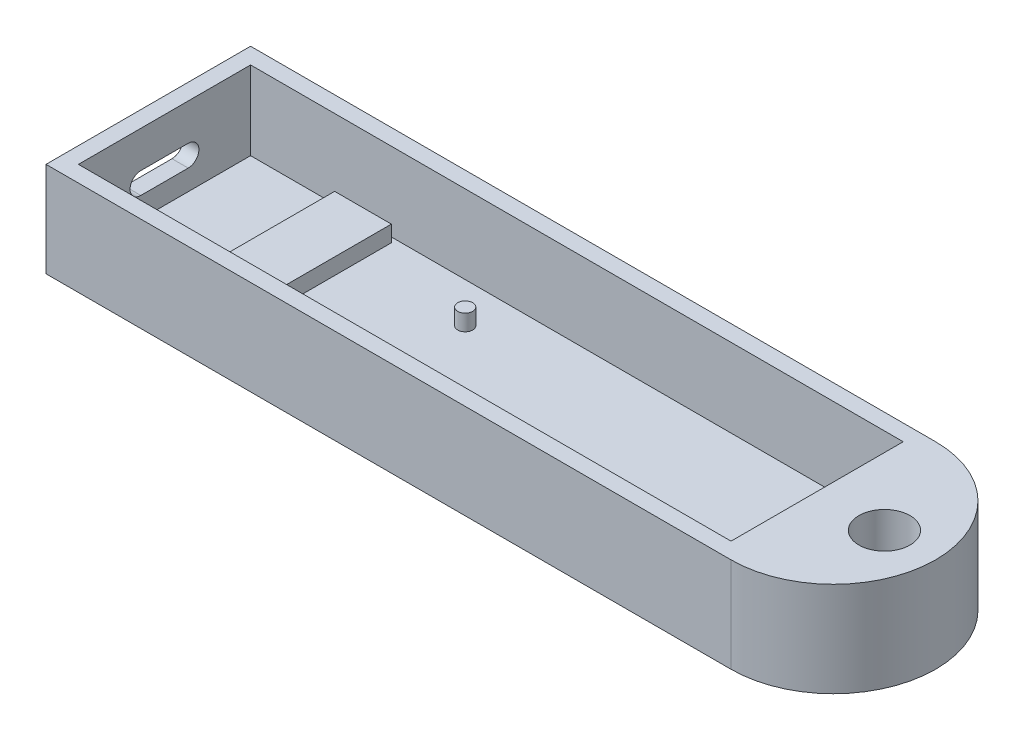
ISO-10303-21;
HEADER;
FILE_DESCRIPTION(('STEP AP214'),'2;1');
FILE_NAME('part.step','',(''),(''),'','','');
FILE_SCHEMA(('AUTOMOTIVE_DESIGN { 1 0 10303 214 1 1 1 1 }'));
ENDSEC;
DATA;
#1=APPLICATION_CONTEXT('core data for automotive mechanical design processes');
#2=APPLICATION_PROTOCOL_DEFINITION('international standard','automotive_design',2000,#1);
#3=PRODUCT_CONTEXT('',#1,'mechanical');
#4=PRODUCT('Part','Part','',(#3));
#5=PRODUCT_RELATED_PRODUCT_CATEGORY('part','',(#4));
#6=PRODUCT_DEFINITION_FORMATION('','',#4);
#7=PRODUCT_DEFINITION_CONTEXT('part definition',#1,'design');
#8=PRODUCT_DEFINITION('design','',#6,#7);
#9=PRODUCT_DEFINITION_SHAPE('','',#8);
#10=(LENGTH_UNIT() NAMED_UNIT(*) SI_UNIT(.MILLI.,.METRE.));
#11=(NAMED_UNIT(*) PLANE_ANGLE_UNIT() SI_UNIT($,.RADIAN.));
#12=(NAMED_UNIT(*) SI_UNIT($,.STERADIAN.) SOLID_ANGLE_UNIT());
#13=UNCERTAINTY_MEASURE_WITH_UNIT(LENGTH_MEASURE(1.E-05),#10,'distance_accuracy_value','');
#14=(GEOMETRIC_REPRESENTATION_CONTEXT(3) GLOBAL_UNCERTAINTY_ASSIGNED_CONTEXT((#13)) GLOBAL_UNIT_ASSIGNED_CONTEXT((#10,
#11,#12)) REPRESENTATION_CONTEXT('',''));
#15=CARTESIAN_POINT('',(0.,0.,0.));
#16=DIRECTION('',(0.,0.,1.));
#17=DIRECTION('',(1.,0.,0.));
#18=AXIS2_PLACEMENT_3D('',#15,#16,#17);
#19=CARTESIAN_POINT('',(-50.2599221877714,11.7,0.));
#20=DIRECTION('',(1.,0.,0.));
#21=DIRECTION('',(0.,0.,-1.));
#22=AXIS2_PLACEMENT_3D('',#19,#20,#21);
#23=PLANE('',#22);
#24=DIRECTION('',(0.,0.,1.));
#25=VECTOR('',#24,1.);
#26=CARTESIAN_POINT('',(-50.2599221877714,0.,0.));
#27=LINE('',#26,#25);
#28=CARTESIAN_POINT('',(-50.2599221877714,0.,-12.5001619157584));
#29=VERTEX_POINT('',#28);
#30=CARTESIAN_POINT('',(-50.2599221877714,0.,12.7498380842416));
#31=VERTEX_POINT('',#30);
#32=EDGE_CURVE('E229',#29,#31,#27,.T.);
#33=ORIENTED_EDGE('',*,*,#32,.T.);
#34=DIRECTION('',(0.,-1.,0.));
#35=VECTOR('',#34,1.);
#36=CARTESIAN_POINT('',(-50.2599221877714,11.7,12.7498380842416));
#37=LINE('',#36,#35);
#38=CARTESIAN_POINT('',(-50.2599221877714,11.7,12.7498380842416));
#39=VERTEX_POINT('',#38);
#40=EDGE_CURVE('E235',#39,#31,#37,.T.);
#41=ORIENTED_EDGE('',*,*,#40,.F.);
#42=DIRECTION('',(0.,0.,1.));
#43=VECTOR('',#42,1.);
#44=CARTESIAN_POINT('',(-50.2599221877714,11.7,0.));
#45=LINE('',#44,#43);
#46=CARTESIAN_POINT('',(-50.2599221877714,11.7,-12.5001619157584));
#47=VERTEX_POINT('',#46);
#48=EDGE_CURVE('E214',#47,#39,#45,.T.);
#49=ORIENTED_EDGE('',*,*,#48,.F.);
#50=DIRECTION('',(0.,-1.,0.));
#51=VECTOR('',#50,1.);
#52=CARTESIAN_POINT('',(-50.2599221877714,11.7,-12.5001619157584));
#53=LINE('',#52,#51);
#54=EDGE_CURVE('E239',#47,#29,#53,.T.);
#55=ORIENTED_EDGE('',*,*,#54,.T.);
#56=EDGE_LOOP('',(#33,#41,#49,#55));
#57=FACE_BOUND('',#56,.T.);
#58=CARTESIAN_POINT('',(-50.2599221877714,5.85,-2.80016191575837));
#59=DIRECTION('',(1.,0.,0.));
#60=DIRECTION('',(0.,0.,-1.));
#61=AXIS2_PLACEMENT_3D('',#58,#59,#60);
#62=CIRCLE('',#61,1.325);
#63=CARTESIAN_POINT('',(-50.2599221877714,7.175,-2.80016191575837));
#64=VERTEX_POINT('',#63);
#65=CARTESIAN_POINT('',(-50.2599221877714,4.525,-2.80016191575837));
#66=VERTEX_POINT('',#65);
#67=EDGE_CURVE('E168',#64,#66,#62,.F.);
#68=ORIENTED_EDGE('',*,*,#67,.F.);
#69=DIRECTION('',(0.,0.,1.));
#70=VECTOR('',#69,1.);
#71=CARTESIAN_POINT('',(-50.2599221877714,7.175,0.));
#72=LINE('',#71,#70);
#73=CARTESIAN_POINT('',(-50.2599221877714,7.175,3.04983808424164));
#74=VERTEX_POINT('',#73);
#75=EDGE_CURVE('E156',#64,#74,#72,.T.);
#76=ORIENTED_EDGE('',*,*,#75,.T.);
#77=CARTESIAN_POINT('',(-50.2599221877714,5.85,3.04983808424163));
#78=DIRECTION('',(1.,0.,0.));
#79=DIRECTION('',(0.,0.,-1.));
#80=AXIS2_PLACEMENT_3D('',#77,#78,#79);
#81=CIRCLE('',#80,1.325);
#82=CARTESIAN_POINT('',(-50.2599221877714,4.525,3.04983808424164));
#83=VERTEX_POINT('',#82);
#84=EDGE_CURVE('E162',#83,#74,#81,.F.);
#85=ORIENTED_EDGE('',*,*,#84,.F.);
#86=DIRECTION('',(0.,0.,1.));
#87=VECTOR('',#86,1.);
#88=CARTESIAN_POINT('',(-50.2599221877714,4.525,0.));
#89=LINE('',#88,#87);
#90=EDGE_CURVE('E174',#66,#83,#89,.T.);
#91=ORIENTED_EDGE('',*,*,#90,.F.);
#92=EDGE_LOOP('',(#68,#76,#85,#91));
#93=FACE_BOUND('',#92,.T.);
#94=ADVANCED_FACE('F45',(#57,#93),#23,.F.);
#95=CARTESIAN_POINT('',(-48.2599221877714,11.7,0.));
#96=DIRECTION('',(1.,0.,0.));
#97=DIRECTION('',(0.,0.,-1.));
#98=AXIS2_PLACEMENT_3D('',#95,#96,#97);
#99=PLANE('',#98);
#100=DIRECTION('',(0.,-1.,0.));
#101=VECTOR('',#100,1.);
#102=CARTESIAN_POINT('',(-48.2599221877714,11.7,10.7498380842416));
#103=LINE('',#102,#101);
#104=CARTESIAN_POINT('',(-48.2599221877714,11.7,10.7498380842416));
#105=VERTEX_POINT('',#104);
#106=CARTESIAN_POINT('',(-48.2599221877714,2.,10.7498380842416));
#107=VERTEX_POINT('',#106);
#108=EDGE_CURVE('E254',#105,#107,#103,.T.);
#109=ORIENTED_EDGE('',*,*,#108,.T.);
#110=DIRECTION('',(0.,0.,1.));
#111=VECTOR('',#110,1.);
#112=CARTESIAN_POINT('',(-48.2599221877714,2.,0.));
#113=LINE('',#112,#111);
#114=CARTESIAN_POINT('',(-48.2599221877714,2.,-10.5001619157584));
#115=VERTEX_POINT('',#114);
#116=EDGE_CURVE('E297',#115,#107,#113,.T.);
#117=ORIENTED_EDGE('',*,*,#116,.F.);
#118=DIRECTION('',(0.,-1.,0.));
#119=VECTOR('',#118,1.);
#120=CARTESIAN_POINT('',(-48.2599221877714,11.7,-10.5001619157584));
#121=LINE('',#120,#119);
#122=CARTESIAN_POINT('',(-48.2599221877714,11.7,-10.5001619157584));
#123=VERTEX_POINT('',#122);
#124=EDGE_CURVE('E220',#123,#115,#121,.T.);
#125=ORIENTED_EDGE('',*,*,#124,.F.);
#126=DIRECTION('',(0.,0.,1.));
#127=VECTOR('',#126,1.);
#128=CARTESIAN_POINT('',(-48.2599221877714,11.7,0.));
#129=LINE('',#128,#127);
#130=EDGE_CURVE('E199',#123,#105,#129,.T.);
#131=ORIENTED_EDGE('',*,*,#130,.T.);
#132=EDGE_LOOP('',(#109,#117,#125,#131));
#133=FACE_BOUND('',#132,.T.);
#134=DIRECTION('',(0.,0.,1.));
#135=VECTOR('',#134,1.);
#136=CARTESIAN_POINT('',(-48.2599221877714,7.175,0.));
#137=LINE('',#136,#135);
#138=CARTESIAN_POINT('',(-48.2599221877714,7.175,-2.80016191575837));
#139=VERTEX_POINT('',#138);
#140=CARTESIAN_POINT('',(-48.2599221877714,7.175,3.04983808424164));
#141=VERTEX_POINT('',#140);
#142=EDGE_CURVE('E352',#139,#141,#137,.T.);
#143=ORIENTED_EDGE('',*,*,#142,.F.);
#144=CARTESIAN_POINT('',(-48.2599221877714,5.85,-2.80016191575837));
#145=DIRECTION('',(1.,0.,0.));
#146=DIRECTION('',(0.,0.,-1.));
#147=AXIS2_PLACEMENT_3D('',#144,#145,#146);
#148=CIRCLE('',#147,1.325);
#149=CARTESIAN_POINT('',(-48.2599221877714,4.525,-2.80016191575837));
#150=VERTEX_POINT('',#149);
#151=EDGE_CURVE('E11',#139,#150,#148,.F.);
#152=ORIENTED_EDGE('',*,*,#151,.T.);
#153=DIRECTION('',(0.,0.,1.));
#154=VECTOR('',#153,1.);
#155=CARTESIAN_POINT('',(-48.2599221877714,4.525,0.));
#156=LINE('',#155,#154);
#157=CARTESIAN_POINT('',(-48.2599221877714,4.525,3.04983808424164));
#158=VERTEX_POINT('',#157);
#159=EDGE_CURVE('E54',#150,#158,#156,.T.);
#160=ORIENTED_EDGE('',*,*,#159,.T.);
#161=CARTESIAN_POINT('',(-48.2599221877714,5.85,3.04983808424163));
#162=DIRECTION('',(1.,0.,0.));
#163=DIRECTION('',(0.,0.,-1.));
#164=AXIS2_PLACEMENT_3D('',#161,#162,#163);
#165=CIRCLE('',#164,1.325);
#166=EDGE_CURVE('E355',#158,#141,#165,.F.);
#167=ORIENTED_EDGE('',*,*,#166,.T.);
#168=EDGE_LOOP('',(#143,#152,#160,#167));
#169=FACE_BOUND('',#168,.T.);
#170=ADVANCED_FACE('F361',(#133,#169),#99,.T.);
#171=CARTESIAN_POINT('',(0.,4.,10.1248380842416));
#172=DIRECTION('',(0.,0.,-1.));
#173=DIRECTION('',(-1.,0.,0.));
#174=AXIS2_PLACEMENT_3D('',#171,#172,#173);
#175=PLANE('',#174);
#176=DIRECTION('',(0.,-1.,0.));
#177=VECTOR('',#176,1.);
#178=CARTESIAN_POINT('',(-37.2599221877714,4.,10.1248380842416));
#179=LINE('',#178,#177);
#180=CARTESIAN_POINT('',(-37.2599221877714,4.,10.1248380842416));
#181=VERTEX_POINT('',#180);
#182=CARTESIAN_POINT('',(-37.2599221877714,2.,10.1248380842416));
#183=VERTEX_POINT('',#182);
#184=EDGE_CURVE('E337',#181,#183,#179,.T.);
#185=ORIENTED_EDGE('',*,*,#184,.T.);
#186=DIRECTION('',(1.,0.,0.));
#187=VECTOR('',#186,1.);
#188=CARTESIAN_POINT('',(0.,2.,10.1248380842416));
#189=LINE('',#188,#187);
#190=CARTESIAN_POINT('',(-30.2599221877714,2.,10.1248380842416));
#191=VERTEX_POINT('',#190);
#192=EDGE_CURVE('E304',#183,#191,#189,.T.);
#193=ORIENTED_EDGE('',*,*,#192,.T.);
#194=DIRECTION('',(0.,-1.,0.));
#195=VECTOR('',#194,1.);
#196=CARTESIAN_POINT('',(-30.2599221877714,4.,10.1248380842416));
#197=LINE('',#196,#195);
#198=CARTESIAN_POINT('',(-30.2599221877714,4.,10.1248380842416));
#199=VERTEX_POINT('',#198);
#200=EDGE_CURVE('E348',#199,#191,#197,.T.);
#201=ORIENTED_EDGE('',*,*,#200,.F.);
#202=DIRECTION('',(1.,0.,0.));
#203=VECTOR('',#202,1.);
#204=CARTESIAN_POINT('',(0.,4.,10.1248380842416));
#205=LINE('',#204,#203);
#206=EDGE_CURVE('E322',#181,#199,#205,.T.);
#207=ORIENTED_EDGE('',*,*,#206,.F.);
#208=EDGE_LOOP('',(#185,#193,#201,#207));
#209=FACE_BOUND('',#208,.T.);
#210=ADVANCED_FACE('F47',(#209),#175,.F.);
#211=CARTESIAN_POINT('',(-30.2599221877714,4.,0.));
#212=DIRECTION('',(-1.,0.,0.));
#213=DIRECTION('',(0.,0.,1.));
#214=AXIS2_PLACEMENT_3D('',#211,#212,#213);
#215=PLANE('',#214);
#216=ORIENTED_EDGE('',*,*,#200,.T.);
#217=DIRECTION('',(0.,0.,-1.));
#218=VECTOR('',#217,1.);
#219=CARTESIAN_POINT('',(-30.2599221877714,2.,0.));
#220=LINE('',#219,#218);
#221=CARTESIAN_POINT('',(-30.2599221877714,2.,-9.87516191575836));
#222=VERTEX_POINT('',#221);
#223=EDGE_CURVE('E301',#191,#222,#220,.T.);
#224=ORIENTED_EDGE('',*,*,#223,.T.);
#225=DIRECTION('',(0.,-1.,0.));
#226=VECTOR('',#225,1.);
#227=CARTESIAN_POINT('',(-30.2599221877714,4.,-9.87516191575836));
#228=LINE('',#227,#226);
#229=CARTESIAN_POINT('',(-30.2599221877714,4.,-9.87516191575836));
#230=VERTEX_POINT('',#229);
#231=EDGE_CURVE('E344',#230,#222,#228,.T.);
#232=ORIENTED_EDGE('',*,*,#231,.F.);
#233=DIRECTION('',(0.,0.,-1.));
#234=VECTOR('',#233,1.);
#235=CARTESIAN_POINT('',(-30.2599221877714,4.,0.));
#236=LINE('',#235,#234);
#237=EDGE_CURVE('E326',#199,#230,#236,.T.);
#238=ORIENTED_EDGE('',*,*,#237,.F.);
#239=EDGE_LOOP('',(#216,#224,#232,#238));
#240=FACE_BOUND('',#239,.T.);
#241=ADVANCED_FACE('F469',(#240),#215,.F.);
#242=CARTESIAN_POINT('',(0.,4.,-9.87516191575836));
#243=DIRECTION('',(0.,0.,-1.));
#244=DIRECTION('',(-1.,0.,0.));
#245=AXIS2_PLACEMENT_3D('',#242,#243,#244);
#246=PLANE('',#245);
#247=DIRECTION('',(1.,0.,0.));
#248=VECTOR('',#247,1.);
#249=CARTESIAN_POINT('',(0.,2.,-9.87516191575836));
#250=LINE('',#249,#248);
#251=CARTESIAN_POINT('',(-37.2599221877714,2.,-9.87516191575836));
#252=VERTEX_POINT('',#251);
#253=EDGE_CURVE('E310',#252,#222,#250,.T.);
#254=ORIENTED_EDGE('',*,*,#253,.F.);
#255=DIRECTION('',(0.,-1.,0.));
#256=VECTOR('',#255,1.);
#257=CARTESIAN_POINT('',(-37.2599221877714,4.,-9.87516191575836));
#258=LINE('',#257,#256);
#259=CARTESIAN_POINT('',(-37.2599221877714,4.,-9.87516191575836));
#260=VERTEX_POINT('',#259);
#261=EDGE_CURVE('E341',#260,#252,#258,.T.);
#262=ORIENTED_EDGE('',*,*,#261,.F.);
#263=DIRECTION('',(1.,0.,0.));
#264=VECTOR('',#263,1.);
#265=CARTESIAN_POINT('',(0.,4.,-9.87516191575836));
#266=LINE('',#265,#264);
#267=EDGE_CURVE('E329',#260,#230,#266,.T.);
#268=ORIENTED_EDGE('',*,*,#267,.T.);
#269=ORIENTED_EDGE('',*,*,#231,.T.);
#270=EDGE_LOOP('',(#254,#262,#268,#269));
#271=FACE_BOUND('',#270,.T.);
#272=ADVANCED_FACE('F466',(#271),#246,.T.);
#273=CARTESIAN_POINT('',(-37.2599221877714,4.,0.));
#274=DIRECTION('',(-1.,0.,0.));
#275=DIRECTION('',(0.,0.,1.));
#276=AXIS2_PLACEMENT_3D('',#273,#274,#275);
#277=PLANE('',#276);
#278=DIRECTION('',(0.,0.,-1.));
#279=VECTOR('',#278,1.);
#280=CARTESIAN_POINT('',(-37.2599221877714,2.,0.));
#281=LINE('',#280,#279);
#282=EDGE_CURVE('E306',#183,#252,#281,.T.);
#283=ORIENTED_EDGE('',*,*,#282,.F.);
#284=ORIENTED_EDGE('',*,*,#184,.F.);
#285=DIRECTION('',(0.,0.,-1.));
#286=VECTOR('',#285,1.);
#287=CARTESIAN_POINT('',(-37.2599221877714,4.,0.));
#288=LINE('',#287,#286);
#289=EDGE_CURVE('E333',#181,#260,#288,.T.);
#290=ORIENTED_EDGE('',*,*,#289,.T.);
#291=ORIENTED_EDGE('',*,*,#261,.T.);
#292=EDGE_LOOP('',(#283,#284,#290,#291));
#293=FACE_BOUND('',#292,.T.);
#294=ADVANCED_FACE('F457',(#293),#277,.T.);
#295=CARTESIAN_POINT('',(0.,4.,0.));
#296=DIRECTION('',(0.,1.,0.));
#297=DIRECTION('',(0.,0.,1.));
#298=AXIS2_PLACEMENT_3D('',#295,#296,#297);
#299=PLANE('',#298);
#300=ORIENTED_EDGE('',*,*,#206,.T.);
#301=ORIENTED_EDGE('',*,*,#237,.T.);
#302=ORIENTED_EDGE('',*,*,#267,.F.);
#303=ORIENTED_EDGE('',*,*,#289,.F.);
#304=EDGE_LOOP('',(#300,#301,#302,#303));
#305=FACE_BOUND('',#304,.T.);
#306=ADVANCED_FACE('F453',(#305),#299,.T.);
#307=CARTESIAN_POINT('',(0.,2.,0.));
#308=DIRECTION('',(0.,1.,0.));
#309=DIRECTION('',(0.,0.,1.));
#310=AXIS2_PLACEMENT_3D('',#307,#308,#309);
#311=PLANE('',#310);
#312=CARTESIAN_POINT('',(-16.8399221877714,2.,7.38135930462612));
#313=DIRECTION('',(0.,1.,0.));
#314=DIRECTION('',(0.,0.,1.));
#315=AXIS2_PLACEMENT_3D('',#312,#313,#314);
#316=CIRCLE('',#315,0.925000000000002);
#317=CARTESIAN_POINT('',(-16.8399221877714,2.,8.30635930462612));
#318=VERTEX_POINT('',#317);
#319=EDGE_CURVE('E279',#318,#318,#316,.T.);
#320=ORIENTED_EDGE('',*,*,#319,.F.);
#321=EDGE_LOOP('',(#320));
#322=FACE_BOUND('',#321,.T.);
#323=CARTESIAN_POINT('',(-16.8399221877714,2.,-5.57016191575837));
#324=DIRECTION('',(0.,1.,0.));
#325=DIRECTION('',(0.,0.,1.));
#326=AXIS2_PLACEMENT_3D('',#323,#324,#325);
#327=CIRCLE('',#326,0.925000000000002);
#328=CARTESIAN_POINT('',(-16.8399221877714,2.,-4.64516191575836));
#329=VERTEX_POINT('',#328);
#330=EDGE_CURVE('E283',#329,#329,#327,.T.);
#331=ORIENTED_EDGE('',*,*,#330,.F.);
#332=EDGE_LOOP('',(#331));
#333=FACE_BOUND('',#332,.T.);
#334=DIRECTION('',(1.,0.,0.));
#335=VECTOR('',#334,1.);
#336=CARTESIAN_POINT('',(0.,2.,10.7498380842416));
#337=LINE('',#336,#335);
#338=CARTESIAN_POINT('',(32.2900778122286,2.,10.7498380842416));
#339=VERTEX_POINT('',#338);
#340=EDGE_CURVE('E287',#107,#339,#337,.T.);
#341=ORIENTED_EDGE('',*,*,#340,.T.);
#342=DIRECTION('',(0.,0.,1.));
#343=VECTOR('',#342,1.);
#344=CARTESIAN_POINT('',(32.2900778122286,2.,0.));
#345=LINE('',#344,#343);
#346=CARTESIAN_POINT('',(32.2900778122286,2.,-10.5001619157584));
#347=VERTEX_POINT('',#346);
#348=EDGE_CURVE('E291',#347,#339,#345,.T.);
#349=ORIENTED_EDGE('',*,*,#348,.F.);
#350=DIRECTION('',(1.,0.,0.));
#351=VECTOR('',#350,1.);
#352=CARTESIAN_POINT('',(0.,2.,-10.5001619157584));
#353=LINE('',#352,#351);
#354=EDGE_CURVE('E294',#115,#347,#353,.T.);
#355=ORIENTED_EDGE('',*,*,#354,.F.);
#356=ORIENTED_EDGE('',*,*,#116,.T.);
#357=EDGE_LOOP('',(#341,#349,#355,#356));
#358=FACE_BOUND('',#357,.T.);
#359=ORIENTED_EDGE('',*,*,#223,.F.);
#360=ORIENTED_EDGE('',*,*,#192,.F.);
#361=ORIENTED_EDGE('',*,*,#282,.T.);
#362=ORIENTED_EDGE('',*,*,#253,.T.);
#363=EDGE_LOOP('',(#359,#360,#361,#362));
#364=FACE_BOUND('',#363,.T.);
#365=CARTESIAN_POINT('',(30.1600778122286,2.,-5.57016191575837));
#366=DIRECTION('',(0.,1.,0.));
#367=DIRECTION('',(0.,0.,1.));
#368=AXIS2_PLACEMENT_3D('',#365,#366,#367);
#369=CIRCLE('',#368,0.925000000000002);
#370=CARTESIAN_POINT('',(30.1600778122286,2.,-4.64516191575836));
#371=VERTEX_POINT('',#370);
#372=EDGE_CURVE('E314',#371,#371,#369,.T.);
#373=ORIENTED_EDGE('',*,*,#372,.F.);
#374=EDGE_LOOP('',(#373));
#375=FACE_BOUND('',#374,.T.);
#376=CARTESIAN_POINT('',(30.1600778122286,2.,7.38135930462612));
#377=DIRECTION('',(0.,1.,0.));
#378=DIRECTION('',(0.,0.,1.));
#379=AXIS2_PLACEMENT_3D('',#376,#377,#378);
#380=CIRCLE('',#379,0.925000000000002);
#381=CARTESIAN_POINT('',(30.1600778122286,2.,8.30635930462612));
#382=VERTEX_POINT('',#381);
#383=EDGE_CURVE('E318',#382,#382,#380,.T.);
#384=ORIENTED_EDGE('',*,*,#383,.F.);
#385=EDGE_LOOP('',(#384));
#386=FACE_BOUND('',#385,.T.);
#387=ADVANCED_FACE('F449',(#322,#333,#358,#364,#375,#386),#311,.T.);
#388=CARTESIAN_POINT('',(-16.8399221877714,4.,-5.57016191575837));
#389=DIRECTION('',(0.,-1.,0.));
#390=DIRECTION('',(0.,0.,-1.));
#391=AXIS2_PLACEMENT_3D('',#388,#389,#390);
#392=CYLINDRICAL_SURFACE('',#391,0.925000000000002);
#393=ORIENTED_EDGE('',*,*,#330,.T.);
#394=EDGE_LOOP('',(#393));
#395=FACE_BOUND('',#394,.T.);
#396=CARTESIAN_POINT('',(-16.8399221877714,4.,-5.57016191575837));
#397=DIRECTION('',(0.,1.,0.));
#398=DIRECTION('',(0.,0.,1.));
#399=AXIS2_PLACEMENT_3D('',#396,#397,#398);
#400=CIRCLE('',#399,0.925000000000002);
#401=CARTESIAN_POINT('',(-16.8399221877714,4.,-4.64516191575836));
#402=VERTEX_POINT('',#401);
#403=EDGE_CURVE('E275',#402,#402,#400,.T.);
#404=ORIENTED_EDGE('',*,*,#403,.F.);
#405=EDGE_LOOP('',(#404));
#406=FACE_BOUND('',#405,.T.);
#407=ADVANCED_FACE('F445',(#395,#406),#392,.T.);
#408=CARTESIAN_POINT('',(-16.8399221877714,4.,-5.57016191575837));
#409=DIRECTION('',(0.,1.,0.));
#410=DIRECTION('',(0.,0.,1.));
#411=AXIS2_PLACEMENT_3D('',#408,#409,#410);
#412=PLANE('',#411);
#413=ORIENTED_EDGE('',*,*,#403,.T.);
#414=EDGE_LOOP('',(#413));
#415=FACE_BOUND('',#414,.T.);
#416=ADVANCED_FACE('F438',(#415),#412,.T.);
#417=CARTESIAN_POINT('',(-16.8399221877714,4.,7.38135930462612));
#418=DIRECTION('',(0.,-1.,0.));
#419=DIRECTION('',(0.,0.,-1.));
#420=AXIS2_PLACEMENT_3D('',#417,#418,#419);
#421=CYLINDRICAL_SURFACE('',#420,0.925000000000002);
#422=ORIENTED_EDGE('',*,*,#319,.T.);
#423=EDGE_LOOP('',(#422));
#424=FACE_BOUND('',#423,.T.);
#425=CARTESIAN_POINT('',(-16.8399221877714,4.,7.38135930462612));
#426=DIRECTION('',(0.,1.,0.));
#427=DIRECTION('',(0.,0.,1.));
#428=AXIS2_PLACEMENT_3D('',#425,#426,#427);
#429=CIRCLE('',#428,0.925000000000002);
#430=CARTESIAN_POINT('',(-16.8399221877714,4.,8.30635930462612));
#431=VERTEX_POINT('',#430);
#432=EDGE_CURVE('E271',#431,#431,#429,.T.);
#433=ORIENTED_EDGE('',*,*,#432,.F.);
#434=EDGE_LOOP('',(#433));
#435=FACE_BOUND('',#434,.T.);
#436=ADVANCED_FACE('F435',(#424,#435),#421,.T.);
#437=CARTESIAN_POINT('',(-16.8399221877714,4.,7.38135930462612));
#438=DIRECTION('',(0.,1.,0.));
#439=DIRECTION('',(0.,0.,1.));
#440=AXIS2_PLACEMENT_3D('',#437,#438,#439);
#441=PLANE('',#440);
#442=ORIENTED_EDGE('',*,*,#432,.T.);
#443=EDGE_LOOP('',(#442));
#444=FACE_BOUND('',#443,.T.);
#445=ADVANCED_FACE('F430',(#444),#441,.T.);
#446=CARTESIAN_POINT('',(30.1600778122286,4.,7.38135930462612));
#447=DIRECTION('',(0.,-1.,0.));
#448=DIRECTION('',(0.,0.,-1.));
#449=AXIS2_PLACEMENT_3D('',#446,#447,#448);
#450=CYLINDRICAL_SURFACE('',#449,0.925000000000002);
#451=ORIENTED_EDGE('',*,*,#383,.T.);
#452=EDGE_LOOP('',(#451));
#453=FACE_BOUND('',#452,.T.);
#454=CARTESIAN_POINT('',(30.1600778122286,4.,7.38135930462612));
#455=DIRECTION('',(0.,1.,0.));
#456=DIRECTION('',(0.,0.,1.));
#457=AXIS2_PLACEMENT_3D('',#454,#455,#456);
#458=CIRCLE('',#457,0.925000000000002);
#459=CARTESIAN_POINT('',(30.1600778122286,4.,8.30635930462612));
#460=VERTEX_POINT('',#459);
#461=EDGE_CURVE('E267',#460,#460,#458,.T.);
#462=ORIENTED_EDGE('',*,*,#461,.F.);
#463=EDGE_LOOP('',(#462));
#464=FACE_BOUND('',#463,.T.);
#465=ADVANCED_FACE('F427',(#453,#464),#450,.T.);
#466=CARTESIAN_POINT('',(30.1600778122286,4.,7.38135930462612));
#467=DIRECTION('',(0.,1.,0.));
#468=DIRECTION('',(0.,0.,1.));
#469=AXIS2_PLACEMENT_3D('',#466,#467,#468);
#470=PLANE('',#469);
#471=ORIENTED_EDGE('',*,*,#461,.T.);
#472=EDGE_LOOP('',(#471));
#473=FACE_BOUND('',#472,.T.);
#474=ADVANCED_FACE('F422',(#473),#470,.T.);
#475=CARTESIAN_POINT('',(30.1600778122286,4.,-5.57016191575837));
#476=DIRECTION('',(0.,-1.,0.));
#477=DIRECTION('',(0.,0.,-1.));
#478=AXIS2_PLACEMENT_3D('',#475,#476,#477);
#479=CYLINDRICAL_SURFACE('',#478,0.925000000000002);
#480=ORIENTED_EDGE('',*,*,#372,.T.);
#481=EDGE_LOOP('',(#480));
#482=FACE_BOUND('',#481,.T.);
#483=CARTESIAN_POINT('',(30.1600778122286,4.,-5.57016191575837));
#484=DIRECTION('',(0.,1.,0.));
#485=DIRECTION('',(0.,0.,1.));
#486=AXIS2_PLACEMENT_3D('',#483,#484,#485);
#487=CIRCLE('',#486,0.925000000000002);
#488=CARTESIAN_POINT('',(30.1600778122286,4.,-4.64516191575836));
#489=VERTEX_POINT('',#488);
#490=EDGE_CURVE('E250',#489,#489,#487,.T.);
#491=ORIENTED_EDGE('',*,*,#490,.F.);
#492=EDGE_LOOP('',(#491));
#493=FACE_BOUND('',#492,.T.);
#494=ADVANCED_FACE('F419',(#482,#493),#479,.T.);
#495=CARTESIAN_POINT('',(30.1600778122286,4.,-5.57016191575837));
#496=DIRECTION('',(0.,1.,0.));
#497=DIRECTION('',(0.,0.,1.));
#498=AXIS2_PLACEMENT_3D('',#495,#496,#497);
#499=PLANE('',#498);
#500=ORIENTED_EDGE('',*,*,#490,.T.);
#501=EDGE_LOOP('',(#500));
#502=FACE_BOUND('',#501,.T.);
#503=ADVANCED_FACE('F405',(#502),#499,.T.);
#504=CARTESIAN_POINT('',(0.,11.7,12.7498380842416));
#505=DIRECTION('',(0.,0.,-1.));
#506=DIRECTION('',(-1.,0.,0.));
#507=AXIS2_PLACEMENT_3D('',#504,#505,#506);
#508=PLANE('',#507);
#509=DIRECTION('',(1.,0.,0.));
#510=VECTOR('',#509,1.);
#511=CARTESIAN_POINT('',(0.,0.,12.7498380842416));
#512=LINE('',#511,#510);
#513=CARTESIAN_POINT('',(34.2900778122286,0.,12.7498380842416));
#514=VERTEX_POINT('',#513);
#515=EDGE_CURVE('E176',#31,#514,#512,.T.);
#516=ORIENTED_EDGE('',*,*,#515,.T.);
#517=DIRECTION('',(0.,-1.,0.));
#518=VECTOR('',#517,1.);
#519=CARTESIAN_POINT('',(34.2900778122286,11.7,12.7498380842416));
#520=LINE('',#519,#518);
#521=CARTESIAN_POINT('',(34.2900778122286,11.7,12.7498380842416));
#522=VERTEX_POINT('',#521);
#523=EDGE_CURVE('E246',#522,#514,#520,.T.);
#524=ORIENTED_EDGE('',*,*,#523,.F.);
#525=DIRECTION('',(1.,0.,0.));
#526=VECTOR('',#525,1.);
#527=CARTESIAN_POINT('',(0.,11.7,12.7498380842416));
#528=LINE('',#527,#526);
#529=EDGE_CURVE('E203',#39,#522,#528,.T.);
#530=ORIENTED_EDGE('',*,*,#529,.F.);
#531=ORIENTED_EDGE('',*,*,#40,.T.);
#532=EDGE_LOOP('',(#516,#524,#530,#531));
#533=FACE_BOUND('',#532,.T.);
#534=ADVANCED_FACE('F402',(#533),#508,.F.);
#535=CARTESIAN_POINT('',(34.2900778122286,11.7,0.124838084241635));
#536=DIRECTION('',(0.,-1.,0.));
#537=DIRECTION('',(0.,0.,-1.));
#538=AXIS2_PLACEMENT_3D('',#535,#536,#537);
#539=CYLINDRICAL_SURFACE('',#538,12.625);
#540=CARTESIAN_POINT('',(34.2900778122286,0.,0.124838084241635));
#541=DIRECTION('',(0.,1.,0.));
#542=DIRECTION('',(0.,0.,1.));
#543=AXIS2_PLACEMENT_3D('',#540,#541,#542);
#544=CIRCLE('',#543,12.625);
#545=CARTESIAN_POINT('',(34.2900778122286,0.,-12.5001619157584));
#546=VERTEX_POINT('',#545);
#547=EDGE_CURVE('E182',#514,#546,#544,.T.);
#548=ORIENTED_EDGE('',*,*,#547,.T.);
#549=DIRECTION('',(0.,-1.,0.));
#550=VECTOR('',#549,1.);
#551=CARTESIAN_POINT('',(34.2900778122286,11.7,-12.5001619157584));
#552=LINE('',#551,#550);
#553=CARTESIAN_POINT('',(34.2900778122286,11.7,-12.5001619157584));
#554=VERTEX_POINT('',#553);
#555=EDGE_CURVE('E243',#554,#546,#552,.T.);
#556=ORIENTED_EDGE('',*,*,#555,.F.);
#557=CARTESIAN_POINT('',(34.2900778122286,11.7,0.124838084241635));
#558=DIRECTION('',(0.,1.,0.));
#559=DIRECTION('',(0.,0.,1.));
#560=AXIS2_PLACEMENT_3D('',#557,#558,#559);
#561=CIRCLE('',#560,12.625);
#562=EDGE_CURVE('E207',#522,#554,#561,.T.);
#563=ORIENTED_EDGE('',*,*,#562,.F.);
#564=ORIENTED_EDGE('',*,*,#523,.T.);
#565=EDGE_LOOP('',(#548,#556,#563,#564));
#566=FACE_BOUND('',#565,.T.);
#567=ADVANCED_FACE('F398',(#566),#539,.T.);
#568=CARTESIAN_POINT('',(0.,11.7,-12.5001619157584));
#569=DIRECTION('',(0.,0.,-1.));
#570=DIRECTION('',(-1.,0.,0.));
#571=AXIS2_PLACEMENT_3D('',#568,#569,#570);
#572=PLANE('',#571);
#573=DIRECTION('',(1.,0.,0.));
#574=VECTOR('',#573,1.);
#575=CARTESIAN_POINT('',(0.,0.,-12.5001619157584));
#576=LINE('',#575,#574);
#577=EDGE_CURVE('E225',#29,#546,#576,.T.);
#578=ORIENTED_EDGE('',*,*,#577,.F.);
#579=ORIENTED_EDGE('',*,*,#54,.F.);
#580=DIRECTION('',(1.,0.,0.));
#581=VECTOR('',#580,1.);
#582=CARTESIAN_POINT('',(0.,11.7,-12.5001619157584));
#583=LINE('',#582,#581);
#584=EDGE_CURVE('E210',#47,#554,#583,.T.);
#585=ORIENTED_EDGE('',*,*,#584,.T.);
#586=ORIENTED_EDGE('',*,*,#555,.T.);
#587=EDGE_LOOP('',(#578,#579,#585,#586));
#588=FACE_BOUND('',#587,.T.);
#589=ADVANCED_FACE('F394',(#588),#572,.T.);
#590=CARTESIAN_POINT('',(0.,11.7,-10.5001619157584));
#591=DIRECTION('',(0.,0.,-1.));
#592=DIRECTION('',(-1.,0.,0.));
#593=AXIS2_PLACEMENT_3D('',#590,#591,#592);
#594=PLANE('',#593);
#595=ORIENTED_EDGE('',*,*,#354,.T.);
#596=DIRECTION('',(0.,-1.,0.));
#597=VECTOR('',#596,1.);
#598=CARTESIAN_POINT('',(32.2900778122286,11.7,-10.5001619157584));
#599=LINE('',#598,#597);
#600=CARTESIAN_POINT('',(32.2900778122286,11.7,-10.5001619157584));
#601=VERTEX_POINT('',#600);
#602=EDGE_CURVE('E240',#601,#347,#599,.T.);
#603=ORIENTED_EDGE('',*,*,#602,.F.);
#604=DIRECTION('',(1.,0.,0.));
#605=VECTOR('',#604,1.);
#606=CARTESIAN_POINT('',(0.,11.7,-10.5001619157584));
#607=LINE('',#606,#605);
#608=EDGE_CURVE('E188',#123,#601,#607,.T.);
#609=ORIENTED_EDGE('',*,*,#608,.F.);
#610=ORIENTED_EDGE('',*,*,#124,.T.);
#611=EDGE_LOOP('',(#595,#603,#609,#610));
#612=FACE_BOUND('',#611,.T.);
#613=ADVANCED_FACE('F397',(#612),#594,.F.);
#614=CARTESIAN_POINT('',(32.2900778122286,11.7,0.));
#615=DIRECTION('',(1.,0.,0.));
#616=DIRECTION('',(0.,0.,-1.));
#617=AXIS2_PLACEMENT_3D('',#614,#615,#616);
#618=PLANE('',#617);
#619=ORIENTED_EDGE('',*,*,#348,.T.);
#620=DIRECTION('',(0.,-1.,0.));
#621=VECTOR('',#620,1.);
#622=CARTESIAN_POINT('',(32.2900778122286,11.7,10.7498380842416));
#623=LINE('',#622,#621);
#624=CARTESIAN_POINT('',(32.2900778122286,11.7,10.7498380842416));
#625=VERTEX_POINT('',#624);
#626=EDGE_CURVE('E257',#625,#339,#623,.T.);
#627=ORIENTED_EDGE('',*,*,#626,.F.);
#628=DIRECTION('',(0.,0.,1.));
#629=VECTOR('',#628,1.);
#630=CARTESIAN_POINT('',(32.2900778122286,11.7,0.));
#631=LINE('',#630,#629);
#632=EDGE_CURVE('E192',#601,#625,#631,.T.);
#633=ORIENTED_EDGE('',*,*,#632,.F.);
#634=ORIENTED_EDGE('',*,*,#602,.T.);
#635=EDGE_LOOP('',(#619,#627,#633,#634));
#636=FACE_BOUND('',#635,.T.);
#637=ADVANCED_FACE('F411',(#636),#618,.F.);
#638=CARTESIAN_POINT('',(0.,11.7,10.7498380842416));
#639=DIRECTION('',(0.,0.,-1.));
#640=DIRECTION('',(-1.,0.,0.));
#641=AXIS2_PLACEMENT_3D('',#638,#639,#640);
#642=PLANE('',#641);
#643=ORIENTED_EDGE('',*,*,#626,.T.);
#644=ORIENTED_EDGE('',*,*,#340,.F.);
#645=ORIENTED_EDGE('',*,*,#108,.F.);
#646=DIRECTION('',(1.,0.,0.));
#647=VECTOR('',#646,1.);
#648=CARTESIAN_POINT('',(0.,11.7,10.7498380842416));
#649=LINE('',#648,#647);
#650=EDGE_CURVE('E195',#105,#625,#649,.T.);
#651=ORIENTED_EDGE('',*,*,#650,.T.);
#652=EDGE_LOOP('',(#643,#644,#645,#651));
#653=FACE_BOUND('',#652,.T.);
#654=ADVANCED_FACE('F408',(#653),#642,.T.);
#655=CARTESIAN_POINT('',(40.6000778122286,11.7,0.124838084241635));
#656=DIRECTION('',(0.,-1.,0.));
#657=DIRECTION('',(0.,0.,-1.));
#658=AXIS2_PLACEMENT_3D('',#655,#656,#657);
#659=CYLINDRICAL_SURFACE('',#658,3.155);
#660=CARTESIAN_POINT('',(40.6000778122286,11.7,0.124838084241635));
#661=DIRECTION('',(0.,1.,0.));
#662=DIRECTION('',(0.,0.,1.));
#663=AXIS2_PLACEMENT_3D('',#660,#661,#662);
#664=CIRCLE('',#663,3.155);
#665=CARTESIAN_POINT('',(40.6000778122286,11.7,3.27983808424163));
#666=VERTEX_POINT('',#665);
#667=EDGE_CURVE('E217',#666,#666,#664,.T.);
#668=ORIENTED_EDGE('',*,*,#667,.T.);
#669=EDGE_LOOP('',(#668));
#670=FACE_BOUND('',#669,.T.);
#671=CARTESIAN_POINT('',(40.6000778122286,0.,0.124838084241635));
#672=DIRECTION('',(0.,1.,0.));
#673=DIRECTION('',(0.,0.,1.));
#674=AXIS2_PLACEMENT_3D('',#671,#672,#673);
#675=CIRCLE('',#674,3.155);
#676=CARTESIAN_POINT('',(40.6000778122286,0.,3.27983808424163));
#677=VERTEX_POINT('',#676);
#678=EDGE_CURVE('E193',#677,#677,#675,.T.);
#679=ORIENTED_EDGE('',*,*,#678,.F.);
#680=EDGE_LOOP('',(#679));
#681=FACE_BOUND('',#680,.T.);
#682=ADVANCED_FACE('F392',(#670,#681),#659,.F.);
#683=CARTESIAN_POINT('',(0.,11.7,0.));
#684=DIRECTION('',(0.,1.,0.));
#685=DIRECTION('',(0.,0.,1.));
#686=AXIS2_PLACEMENT_3D('',#683,#684,#685);
#687=PLANE('',#686);
#688=ORIENTED_EDGE('',*,*,#608,.T.);
#689=ORIENTED_EDGE('',*,*,#632,.T.);
#690=ORIENTED_EDGE('',*,*,#650,.F.);
#691=ORIENTED_EDGE('',*,*,#130,.F.);
#692=EDGE_LOOP('',(#688,#689,#690,#691));
#693=FACE_BOUND('',#692,.T.);
#694=ORIENTED_EDGE('',*,*,#529,.T.);
#695=ORIENTED_EDGE('',*,*,#562,.T.);
#696=ORIENTED_EDGE('',*,*,#584,.F.);
#697=ORIENTED_EDGE('',*,*,#48,.T.);
#698=EDGE_LOOP('',(#694,#695,#696,#697));
#699=FACE_BOUND('',#698,.T.);
#700=ORIENTED_EDGE('',*,*,#667,.F.);
#701=EDGE_LOOP('',(#700));
#702=FACE_BOUND('',#701,.T.);
#703=ADVANCED_FACE('F462',(#693,#699,#702),#687,.T.);
#704=CARTESIAN_POINT('',(0.,0.,0.));
#705=DIRECTION('',(0.,1.,0.));
#706=DIRECTION('',(0.,0.,1.));
#707=AXIS2_PLACEMENT_3D('',#704,#705,#706);
#708=PLANE('',#707);
#709=ORIENTED_EDGE('',*,*,#515,.F.);
#710=ORIENTED_EDGE('',*,*,#32,.F.);
#711=ORIENTED_EDGE('',*,*,#577,.T.);
#712=ORIENTED_EDGE('',*,*,#547,.F.);
#713=EDGE_LOOP('',(#709,#710,#711,#712));
#714=FACE_BOUND('',#713,.T.);
#715=ORIENTED_EDGE('',*,*,#678,.T.);
#716=EDGE_LOOP('',(#715));
#717=FACE_BOUND('',#716,.T.);
#718=ADVANCED_FACE('F459',(#714,#717),#708,.F.);
#719=CARTESIAN_POINT('',(-55.1099221877714,5.85,-2.80016191575837));
#720=DIRECTION('',(1.,0.,0.));
#721=DIRECTION('',(0.,0.,-1.));
#722=AXIS2_PLACEMENT_3D('',#719,#720,#721);
#723=CYLINDRICAL_SURFACE('',#722,1.325);
#724=ORIENTED_EDGE('',*,*,#67,.T.);
#725=DIRECTION('',(1.,0.,0.));
#726=VECTOR('',#725,1.);
#727=CARTESIAN_POINT('',(-55.1099221877714,4.525,-2.80016191575837));
#728=LINE('',#727,#726);
#729=EDGE_CURVE('E163',#66,#150,#728,.T.);
#730=ORIENTED_EDGE('',*,*,#729,.T.);
#731=ORIENTED_EDGE('',*,*,#151,.F.);
#732=DIRECTION('',(1.,0.,0.));
#733=VECTOR('',#732,1.);
#734=CARTESIAN_POINT('',(-55.1099221877714,7.175,-2.80016191575837));
#735=LINE('',#734,#733);
#736=EDGE_CURVE('E66',#64,#139,#735,.T.);
#737=ORIENTED_EDGE('',*,*,#736,.F.);
#738=EDGE_LOOP('',(#724,#730,#731,#737));
#739=FACE_BOUND('',#738,.T.);
#740=ADVANCED_FACE('F166',(#739),#723,.F.);
#741=CARTESIAN_POINT('',(-55.1099221877714,4.525,-2.80016191575837));
#742=DIRECTION('',(0.,1.,0.));
#743=DIRECTION('',(0.,0.,1.));
#744=AXIS2_PLACEMENT_3D('',#741,#742,#743);
#745=PLANE('',#744);
#746=ORIENTED_EDGE('',*,*,#90,.T.);
#747=DIRECTION('',(1.,0.,0.));
#748=VECTOR('',#747,1.);
#749=CARTESIAN_POINT('',(-55.1099221877714,4.525,3.04983808424164));
#750=LINE('',#749,#748);
#751=EDGE_CURVE('E366',#83,#158,#750,.T.);
#752=ORIENTED_EDGE('',*,*,#751,.T.);
#753=ORIENTED_EDGE('',*,*,#159,.F.);
#754=ORIENTED_EDGE('',*,*,#729,.F.);
#755=EDGE_LOOP('',(#746,#752,#753,#754));
#756=FACE_BOUND('',#755,.T.);
#757=ADVANCED_FACE('F364',(#756),#745,.T.);
#758=CARTESIAN_POINT('',(-55.1099221877714,5.85,3.04983808424163));
#759=DIRECTION('',(1.,0.,0.));
#760=DIRECTION('',(0.,0.,-1.));
#761=AXIS2_PLACEMENT_3D('',#758,#759,#760);
#762=CYLINDRICAL_SURFACE('',#761,1.325);
#763=ORIENTED_EDGE('',*,*,#84,.T.);
#764=DIRECTION('',(1.,0.,0.));
#765=VECTOR('',#764,1.);
#766=CARTESIAN_POINT('',(-55.1099221877714,7.175,3.04983808424164));
#767=LINE('',#766,#765);
#768=EDGE_CURVE('E61',#74,#141,#767,.T.);
#769=ORIENTED_EDGE('',*,*,#768,.T.);
#770=ORIENTED_EDGE('',*,*,#166,.F.);
#771=ORIENTED_EDGE('',*,*,#751,.F.);
#772=EDGE_LOOP('',(#763,#769,#770,#771));
#773=FACE_BOUND('',#772,.T.);
#774=ADVANCED_FACE('F374',(#773),#762,.F.);
#775=CARTESIAN_POINT('',(-55.1099221877714,7.175,-2.80016191575837));
#776=DIRECTION('',(0.,1.,0.));
#777=DIRECTION('',(0.,0.,1.));
#778=AXIS2_PLACEMENT_3D('',#775,#776,#777);
#779=PLANE('',#778);
#780=ORIENTED_EDGE('',*,*,#736,.T.);
#781=ORIENTED_EDGE('',*,*,#142,.T.);
#782=ORIENTED_EDGE('',*,*,#768,.F.);
#783=ORIENTED_EDGE('',*,*,#75,.F.);
#784=EDGE_LOOP('',(#780,#781,#782,#783));
#785=FACE_BOUND('',#784,.T.);
#786=ADVANCED_FACE('F157',(#785),#779,.F.);
#787=CLOSED_SHELL('',(#94,#170,#210,#241,#272,#294,#306,#387,#407,#416,#436,#445,#465,#474,#494,
#503,#534,#567,#589,#613,#637,#654,#682,#703,#718,#740,#757,#774,#786));
#788=MANIFOLD_SOLID_BREP('B2',#787);
#789=ADVANCED_BREP_SHAPE_REPRESENTATION('',(#18,#788),#14);
#790=SHAPE_DEFINITION_REPRESENTATION(#9,#789);
ENDSEC;
END-ISO-10303-21;
